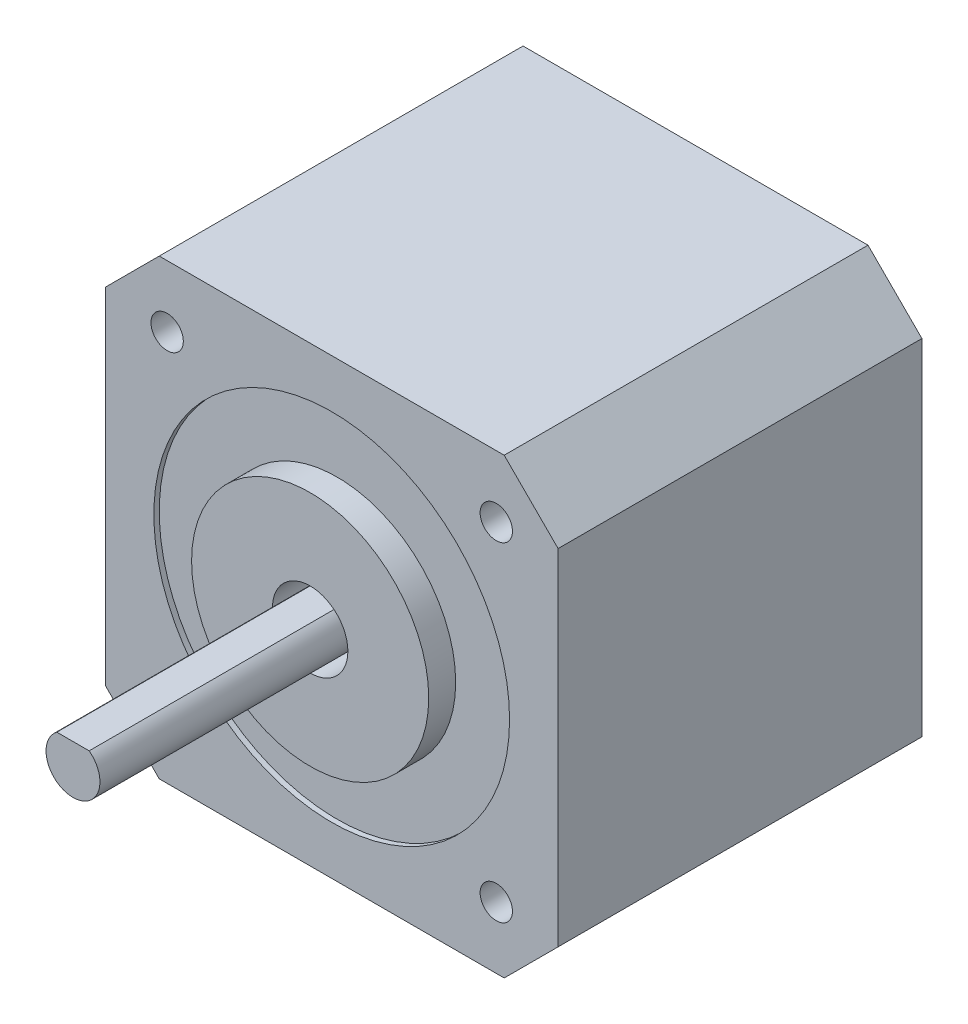
ISO-10303-21;
HEADER;
FILE_DESCRIPTION(('STEP AP214'),'2;1');
FILE_NAME('part.step','',(''),(''),'','','');
FILE_SCHEMA(('AUTOMOTIVE_DESIGN { 1 0 10303 214 1 1 1 1 }'));
ENDSEC;
DATA;
#1=APPLICATION_CONTEXT('core data for automotive mechanical design processes');
#2=APPLICATION_PROTOCOL_DEFINITION('international standard','automotive_design',2000,#1);
#3=PRODUCT_CONTEXT('',#1,'mechanical');
#4=PRODUCT('Part','Part','',(#3));
#5=PRODUCT_RELATED_PRODUCT_CATEGORY('part','',(#4));
#6=PRODUCT_DEFINITION_FORMATION('','',#4);
#7=PRODUCT_DEFINITION_CONTEXT('part definition',#1,'design');
#8=PRODUCT_DEFINITION('design','',#6,#7);
#9=PRODUCT_DEFINITION_SHAPE('','',#8);
#10=(LENGTH_UNIT() NAMED_UNIT(*) SI_UNIT(.MILLI.,.METRE.));
#11=(NAMED_UNIT(*) PLANE_ANGLE_UNIT() SI_UNIT($,.RADIAN.));
#12=(NAMED_UNIT(*) SI_UNIT($,.STERADIAN.) SOLID_ANGLE_UNIT());
#13=UNCERTAINTY_MEASURE_WITH_UNIT(LENGTH_MEASURE(1.E-05),#10,'distance_accuracy_value','');
#14=(GEOMETRIC_REPRESENTATION_CONTEXT(3) GLOBAL_UNCERTAINTY_ASSIGNED_CONTEXT((#13)) GLOBAL_UNIT_ASSIGNED_CONTEXT((#10,
#11,#12)) REPRESENTATION_CONTEXT('',''));
#15=CARTESIAN_POINT('',(0.,0.,0.));
#16=DIRECTION('',(0.,0.,1.));
#17=DIRECTION('',(1.,0.,0.));
#18=AXIS2_PLACEMENT_3D('',#15,#16,#17);
#19=CARTESIAN_POINT('',(0.,0.,0.));
#20=DIRECTION('',(0.,0.,1.));
#21=DIRECTION('',(1.,0.,0.));
#22=AXIS2_PLACEMENT_3D('',#19,#20,#21);
#23=PLANE('',#22);
#24=CARTESIAN_POINT('',(-34.2472819078425,39.9049488656762,0.));
#25=DIRECTION('',(0.,0.,1.));
#26=DIRECTION('',(1.,0.,0.));
#27=AXIS2_PLACEMENT_3D('',#24,#25,#26);
#28=CIRCLE('',#27,1.5);
#29=CARTESIAN_POINT('',(-32.7472819078425,39.9049488656762,0.));
#30=VERTEX_POINT('',#29);
#31=EDGE_CURVE('E260',#30,#30,#28,.T.);
#32=ORIENTED_EDGE('',*,*,#31,.T.);
#33=EDGE_LOOP('',(#32));
#34=FACE_BOUND('',#33,.T.);
#35=CARTESIAN_POINT('',(-34.2472819078425,9.3720780540411,0.));
#36=DIRECTION('',(0.,0.,1.));
#37=DIRECTION('',(1.,0.,0.));
#38=AXIS2_PLACEMENT_3D('',#35,#36,#37);
#39=CIRCLE('',#38,1.5);
#40=CARTESIAN_POINT('',(-32.7472819078425,9.3720780540411,0.));
#41=VERTEX_POINT('',#40);
#42=EDGE_CURVE('E248',#41,#41,#39,.T.);
#43=ORIENTED_EDGE('',*,*,#42,.T.);
#44=EDGE_LOOP('',(#43));
#45=FACE_BOUND('',#44,.T.);
#46=DIRECTION('',(0.,-1.,0.));
#47=VECTOR('',#46,1.);
#48=CARTESIAN_POINT('',(-39.9808465020249,40.6385134598587,0.));
#49=LINE('',#48,#47);
#50=CARTESIAN_POINT('',(-39.9808465020249,40.6385134598587,0.));
#51=VERTEX_POINT('',#50);
#52=CARTESIAN_POINT('',(-39.9808465020249,8.63851345985866,0.));
#53=VERTEX_POINT('',#52);
#54=EDGE_CURVE('E143',#51,#53,#49,.T.);
#55=ORIENTED_EDGE('',*,*,#54,.F.);
#56=DIRECTION('',(-0.707106781186547,-0.707106781186547,0.));
#57=VECTOR('',#56,1.);
#58=CARTESIAN_POINT('',(-34.9808465020249,45.6385134598587,0.));
#59=LINE('',#58,#57);
#60=CARTESIAN_POINT('',(-34.9808465020249,45.6385134598587,0.));
#61=VERTEX_POINT('',#60);
#62=EDGE_CURVE('E91',#61,#51,#59,.T.);
#63=ORIENTED_EDGE('',*,*,#62,.F.);
#64=DIRECTION('',(-1.,0.,0.));
#65=VECTOR('',#64,1.);
#66=CARTESIAN_POINT('',(-34.9808465020249,45.6385134598587,0.));
#67=LINE('',#66,#65);
#68=CARTESIAN_POINT('',(-2.98084650202495,45.6385134598587,0.));
#69=VERTEX_POINT('',#68);
#70=EDGE_CURVE('E156',#69,#61,#67,.T.);
#71=ORIENTED_EDGE('',*,*,#70,.F.);
#72=DIRECTION('',(-0.707106781186548,0.707106781186547,0.));
#73=VECTOR('',#72,1.);
#74=CARTESIAN_POINT('',(-2.98084650202495,45.6385134598587,0.));
#75=LINE('',#74,#73);
#76=CARTESIAN_POINT('',(2.01915349797506,40.6385134598587,0.));
#77=VERTEX_POINT('',#76);
#78=EDGE_CURVE('E131',#77,#69,#75,.T.);
#79=ORIENTED_EDGE('',*,*,#78,.F.);
#80=DIRECTION('',(0.,1.,0.));
#81=VECTOR('',#80,1.);
#82=CARTESIAN_POINT('',(2.01915349797506,40.6385134598587,0.));
#83=LINE('',#82,#81);
#84=CARTESIAN_POINT('',(2.01915349797507,8.63851345985866,0.));
#85=VERTEX_POINT('',#84);
#86=EDGE_CURVE('E153',#85,#77,#83,.T.);
#87=ORIENTED_EDGE('',*,*,#86,.F.);
#88=DIRECTION('',(0.707106781186547,0.707106781186548,0.));
#89=VECTOR('',#88,1.);
#90=CARTESIAN_POINT('',(2.01915349797507,8.63851345985866,0.));
#91=LINE('',#90,#89);
#92=CARTESIAN_POINT('',(-2.98084650202493,3.63851345985865,0.));
#93=VERTEX_POINT('',#92);
#94=EDGE_CURVE('E151',#93,#85,#91,.T.);
#95=ORIENTED_EDGE('',*,*,#94,.F.);
#96=DIRECTION('',(1.,0.,0.));
#97=VECTOR('',#96,1.);
#98=CARTESIAN_POINT('',(-34.9808465020249,3.63851345985865,0.));
#99=LINE('',#98,#97);
#100=CARTESIAN_POINT('',(-34.9808465020249,3.63851345985865,0.));
#101=VERTEX_POINT('',#100);
#102=EDGE_CURVE('E149',#101,#93,#99,.T.);
#103=ORIENTED_EDGE('',*,*,#102,.F.);
#104=DIRECTION('',(0.707106781186547,-0.707106781186548,0.));
#105=VECTOR('',#104,1.);
#106=CARTESIAN_POINT('',(-39.9808465020249,8.63851345985866,0.));
#107=LINE('',#106,#105);
#108=EDGE_CURVE('E146',#53,#101,#107,.T.);
#109=ORIENTED_EDGE('',*,*,#108,.F.);
#110=EDGE_LOOP('',(#55,#63,#71,#79,#87,#95,#103,#109));
#111=FACE_BOUND('',#110,.T.);
#112=CARTESIAN_POINT('',(-3.71441109620737,9.3720780540411,0.));
#113=DIRECTION('',(0.,0.,1.));
#114=DIRECTION('',(1.,0.,0.));
#115=AXIS2_PLACEMENT_3D('',#112,#113,#114);
#116=CIRCLE('',#115,1.5);
#117=CARTESIAN_POINT('',(-2.21441109620737,9.3720780540411,0.));
#118=VERTEX_POINT('',#117);
#119=EDGE_CURVE('E254',#118,#118,#116,.T.);
#120=ORIENTED_EDGE('',*,*,#119,.T.);
#121=EDGE_LOOP('',(#120));
#122=FACE_BOUND('',#121,.T.);
#123=CARTESIAN_POINT('',(-3.71441109620737,39.9049488656762,0.));
#124=DIRECTION('',(0.,0.,1.));
#125=DIRECTION('',(1.,0.,0.));
#126=AXIS2_PLACEMENT_3D('',#123,#124,#125);
#127=CIRCLE('',#126,1.5);
#128=CARTESIAN_POINT('',(-2.21441109620737,39.9049488656762,0.));
#129=VERTEX_POINT('',#128);
#130=EDGE_CURVE('E266',#129,#129,#127,.T.);
#131=ORIENTED_EDGE('',*,*,#130,.T.);
#132=EDGE_LOOP('',(#131));
#133=FACE_BOUND('',#132,.T.);
#134=ADVANCED_FACE('F34',(#34,#45,#111,#122,#133),#23,.F.);
#135=CARTESIAN_POINT('',(-18.9808465020249,24.6385134598587,30.75));
#136=DIRECTION('',(0.,0.,1.));
#137=DIRECTION('',(1.,0.,0.));
#138=AXIS2_PLACEMENT_3D('',#135,#136,#137);
#139=PLANE('',#138);
#140=CARTESIAN_POINT('',(-18.9808465020249,24.6385134598587,30.75));
#141=DIRECTION('',(0.,0.,1.));
#142=DIRECTION('',(1.,0.,0.));
#143=AXIS2_PLACEMENT_3D('',#140,#141,#142);
#144=CIRCLE('',#143,3.5);
#145=CARTESIAN_POINT('',(-15.4808465020249,24.6385134598587,30.75));
#146=VERTEX_POINT('',#145);
#147=EDGE_CURVE('E201',#146,#146,#144,.T.);
#148=ORIENTED_EDGE('',*,*,#147,.T.);
#149=EDGE_LOOP('',(#148));
#150=FACE_BOUND('',#149,.T.);
#151=DIRECTION('',(-1.,0.,0.));
#152=VECTOR('',#151,1.);
#153=CARTESIAN_POINT('',(-20.4808465020249,26.6385134598587,30.75));
#154=LINE('',#153,#152);
#155=CARTESIAN_POINT('',(-17.4808465020249,26.6385134598587,30.75));
#156=VERTEX_POINT('',#155);
#157=CARTESIAN_POINT('',(-20.4808465020249,26.6385134598587,30.75));
#158=VERTEX_POINT('',#157);
#159=EDGE_CURVE('E214',#156,#158,#154,.T.);
#160=ORIENTED_EDGE('',*,*,#159,.F.);
#161=CARTESIAN_POINT('',(-18.9808465020249,24.6385134598587,30.75));
#162=DIRECTION('',(0.,0.,1.));
#163=DIRECTION('',(1.,0.,0.));
#164=AXIS2_PLACEMENT_3D('',#161,#162,#163);
#165=CIRCLE('',#164,2.5);
#166=EDGE_CURVE('E49',#158,#156,#165,.T.);
#167=ORIENTED_EDGE('',*,*,#166,.F.);
#168=EDGE_LOOP('',(#160,#167));
#169=FACE_BOUND('',#168,.T.);
#170=ADVANCED_FACE('F284',(#150,#169),#139,.T.);
#171=CARTESIAN_POINT('',(-18.9808465020249,24.6385134598587,33.25));
#172=DIRECTION('',(0.,0.,1.));
#173=DIRECTION('',(1.,0.,0.));
#174=AXIS2_PLACEMENT_3D('',#171,#172,#173);
#175=PLANE('',#174);
#176=CARTESIAN_POINT('',(-18.9808465020249,24.6385134598587,33.25));
#177=DIRECTION('',(0.,0.,1.));
#178=DIRECTION('',(1.,0.,0.));
#179=AXIS2_PLACEMENT_3D('',#176,#177,#178);
#180=CIRCLE('',#179,16.5);
#181=CARTESIAN_POINT('',(-2.48084650202493,24.6385134598587,33.25));
#182=VERTEX_POINT('',#181);
#183=EDGE_CURVE('E147',#182,#182,#180,.T.);
#184=ORIENTED_EDGE('',*,*,#183,.T.);
#185=EDGE_LOOP('',(#184));
#186=FACE_BOUND('',#185,.T.);
#187=CARTESIAN_POINT('',(-18.9808465020249,24.6385134598587,33.25));
#188=DIRECTION('',(0.,0.,1.));
#189=DIRECTION('',(1.,0.,0.));
#190=AXIS2_PLACEMENT_3D('',#187,#188,#189);
#191=CIRCLE('',#190,11.);
#192=CARTESIAN_POINT('',(-7.98084650202494,24.6385134598587,33.25));
#193=VERTEX_POINT('',#192);
#194=EDGE_CURVE('E198',#193,#193,#191,.T.);
#195=ORIENTED_EDGE('',*,*,#194,.F.);
#196=EDGE_LOOP('',(#195));
#197=FACE_BOUND('',#196,.T.);
#198=ADVANCED_FACE('F290',(#186,#197),#175,.T.);
#199=CARTESIAN_POINT('',(-39.9808465020249,40.6385134598587,33.75));
#200=DIRECTION('',(1.,0.,0.));
#201=DIRECTION('',(0.,1.,0.));
#202=AXIS2_PLACEMENT_3D('',#199,#200,#201);
#203=PLANE('',#202);
#204=ORIENTED_EDGE('',*,*,#54,.T.);
#205=DIRECTION('',(0.,0.,-1.));
#206=VECTOR('',#205,1.);
#207=CARTESIAN_POINT('',(-39.9808465020249,8.63851345985866,33.75));
#208=LINE('',#207,#206);
#209=CARTESIAN_POINT('',(-39.9808465020249,8.63851345985866,33.75));
#210=VERTEX_POINT('',#209);
#211=EDGE_CURVE('E11',#210,#53,#208,.T.);
#212=ORIENTED_EDGE('',*,*,#211,.F.);
#213=DIRECTION('',(0.,-1.,0.));
#214=VECTOR('',#213,1.);
#215=CARTESIAN_POINT('',(-39.9808465020249,40.6385134598587,33.75));
#216=LINE('',#215,#214);
#217=CARTESIAN_POINT('',(-39.9808465020249,40.6385134598587,33.75));
#218=VERTEX_POINT('',#217);
#219=EDGE_CURVE('E159',#218,#210,#216,.T.);
#220=ORIENTED_EDGE('',*,*,#219,.F.);
#221=DIRECTION('',(0.,0.,-1.));
#222=VECTOR('',#221,1.);
#223=CARTESIAN_POINT('',(-39.9808465020249,40.6385134598587,33.75));
#224=LINE('',#223,#222);
#225=EDGE_CURVE('E139',#218,#51,#224,.T.);
#226=ORIENTED_EDGE('',*,*,#225,.T.);
#227=EDGE_LOOP('',(#204,#212,#220,#226));
#228=FACE_BOUND('',#227,.T.);
#229=ADVANCED_FACE('F36',(#228),#203,.F.);
#230=CARTESIAN_POINT('',(-39.9808465020249,8.63851345985866,33.75));
#231=DIRECTION('',(0.707106781186548,0.707106781186547,0.));
#232=DIRECTION('',(-0.707106781186547,0.707106781186548,0.));
#233=AXIS2_PLACEMENT_3D('',#230,#231,#232);
#234=PLANE('',#233);
#235=ORIENTED_EDGE('',*,*,#108,.T.);
#236=DIRECTION('',(0.,0.,-1.));
#237=VECTOR('',#236,1.);
#238=CARTESIAN_POINT('',(-34.9808465020249,3.63851345985865,33.75));
#239=LINE('',#238,#237);
#240=CARTESIAN_POINT('',(-34.9808465020249,3.63851345985865,33.75));
#241=VERTEX_POINT('',#240);
#242=EDGE_CURVE('E42',#241,#101,#239,.T.);
#243=ORIENTED_EDGE('',*,*,#242,.F.);
#244=DIRECTION('',(0.707106781186547,-0.707106781186548,0.));
#245=VECTOR('',#244,1.);
#246=CARTESIAN_POINT('',(-39.9808465020249,8.63851345985866,33.75));
#247=LINE('',#246,#245);
#248=EDGE_CURVE('E99',#210,#241,#247,.T.);
#249=ORIENTED_EDGE('',*,*,#248,.F.);
#250=ORIENTED_EDGE('',*,*,#211,.T.);
#251=EDGE_LOOP('',(#235,#243,#249,#250));
#252=FACE_BOUND('',#251,.T.);
#253=ADVANCED_FACE('F309',(#252),#234,.F.);
#254=CARTESIAN_POINT('',(-34.9808465020249,3.63851345985865,33.75));
#255=DIRECTION('',(0.,1.,0.));
#256=DIRECTION('',(0.,0.,1.));
#257=AXIS2_PLACEMENT_3D('',#254,#255,#256);
#258=PLANE('',#257);
#259=ORIENTED_EDGE('',*,*,#102,.T.);
#260=DIRECTION('',(0.,0.,-1.));
#261=VECTOR('',#260,1.);
#262=CARTESIAN_POINT('',(-2.98084650202493,3.63851345985865,33.75));
#263=LINE('',#262,#261);
#264=CARTESIAN_POINT('',(-2.98084650202493,3.63851345985865,33.75));
#265=VERTEX_POINT('',#264);
#266=EDGE_CURVE('E166',#265,#93,#263,.T.);
#267=ORIENTED_EDGE('',*,*,#266,.F.);
#268=DIRECTION('',(1.,0.,0.));
#269=VECTOR('',#268,1.);
#270=CARTESIAN_POINT('',(-34.9808465020249,3.63851345985865,33.75));
#271=LINE('',#270,#269);
#272=EDGE_CURVE('E174',#241,#265,#271,.T.);
#273=ORIENTED_EDGE('',*,*,#272,.F.);
#274=ORIENTED_EDGE('',*,*,#242,.T.);
#275=EDGE_LOOP('',(#259,#267,#273,#274));
#276=FACE_BOUND('',#275,.T.);
#277=ADVANCED_FACE('F172',(#276),#258,.F.);
#278=CARTESIAN_POINT('',(2.01915349797507,8.63851345985866,33.75));
#279=DIRECTION('',(-0.707106781186548,0.707106781186547,0.));
#280=DIRECTION('',(-0.707106781186547,-0.707106781186548,0.));
#281=AXIS2_PLACEMENT_3D('',#278,#279,#280);
#282=PLANE('',#281);
#283=ORIENTED_EDGE('',*,*,#94,.T.);
#284=DIRECTION('',(0.,0.,-1.));
#285=VECTOR('',#284,1.);
#286=CARTESIAN_POINT('',(2.01915349797507,8.63851345985866,33.75));
#287=LINE('',#286,#285);
#288=CARTESIAN_POINT('',(2.01915349797507,8.63851345985866,33.75));
#289=VERTEX_POINT('',#288);
#290=EDGE_CURVE('E163',#289,#85,#287,.T.);
#291=ORIENTED_EDGE('',*,*,#290,.F.);
#292=DIRECTION('',(0.707106781186547,0.707106781186548,0.));
#293=VECTOR('',#292,1.);
#294=CARTESIAN_POINT('',(2.01915349797507,8.63851345985866,33.75));
#295=LINE('',#294,#293);
#296=EDGE_CURVE('E186',#265,#289,#295,.T.);
#297=ORIENTED_EDGE('',*,*,#296,.F.);
#298=ORIENTED_EDGE('',*,*,#266,.T.);
#299=EDGE_LOOP('',(#283,#291,#297,#298));
#300=FACE_BOUND('',#299,.T.);
#301=ADVANCED_FACE('F182',(#300),#282,.F.);
#302=CARTESIAN_POINT('',(2.01915349797506,40.6385134598587,33.75));
#303=DIRECTION('',(-1.,0.,0.));
#304=DIRECTION('',(0.,-1.,0.));
#305=AXIS2_PLACEMENT_3D('',#302,#303,#304);
#306=PLANE('',#305);
#307=ORIENTED_EDGE('',*,*,#86,.T.);
#308=DIRECTION('',(0.,0.,-1.));
#309=VECTOR('',#308,1.);
#310=CARTESIAN_POINT('',(2.01915349797506,40.6385134598587,33.75));
#311=LINE('',#310,#309);
#312=CARTESIAN_POINT('',(2.01915349797506,40.6385134598587,33.75));
#313=VERTEX_POINT('',#312);
#314=EDGE_CURVE('E134',#313,#77,#311,.T.);
#315=ORIENTED_EDGE('',*,*,#314,.F.);
#316=DIRECTION('',(0.,1.,0.));
#317=VECTOR('',#316,1.);
#318=CARTESIAN_POINT('',(2.01915349797506,40.6385134598587,33.75));
#319=LINE('',#318,#317);
#320=EDGE_CURVE('E122',#289,#313,#319,.T.);
#321=ORIENTED_EDGE('',*,*,#320,.F.);
#322=ORIENTED_EDGE('',*,*,#290,.T.);
#323=EDGE_LOOP('',(#307,#315,#321,#322));
#324=FACE_BOUND('',#323,.T.);
#325=ADVANCED_FACE('F185',(#324),#306,.F.);
#326=CARTESIAN_POINT('',(-2.98084650202495,45.6385134598587,33.75));
#327=DIRECTION('',(-0.707106781186547,-0.707106781186548,0.));
#328=DIRECTION('',(0.707106781186548,-0.707106781186547,0.));
#329=AXIS2_PLACEMENT_3D('',#326,#327,#328);
#330=PLANE('',#329);
#331=ORIENTED_EDGE('',*,*,#78,.T.);
#332=DIRECTION('',(0.,0.,-1.));
#333=VECTOR('',#332,1.);
#334=CARTESIAN_POINT('',(-2.98084650202495,45.6385134598587,33.75));
#335=LINE('',#334,#333);
#336=CARTESIAN_POINT('',(-2.98084650202495,45.6385134598587,33.75));
#337=VERTEX_POINT('',#336);
#338=EDGE_CURVE('E128',#337,#69,#335,.T.);
#339=ORIENTED_EDGE('',*,*,#338,.F.);
#340=DIRECTION('',(-0.707106781186548,0.707106781186547,0.));
#341=VECTOR('',#340,1.);
#342=CARTESIAN_POINT('',(-2.98084650202495,45.6385134598587,33.75));
#343=LINE('',#342,#341);
#344=EDGE_CURVE('E115',#313,#337,#343,.T.);
#345=ORIENTED_EDGE('',*,*,#344,.F.);
#346=ORIENTED_EDGE('',*,*,#314,.T.);
#347=EDGE_LOOP('',(#331,#339,#345,#346));
#348=FACE_BOUND('',#347,.T.);
#349=ADVANCED_FACE('F129',(#348),#330,.F.);
#350=CARTESIAN_POINT('',(-34.9808465020249,45.6385134598587,33.75));
#351=DIRECTION('',(0.,-1.,0.));
#352=DIRECTION('',(0.,0.,-1.));
#353=AXIS2_PLACEMENT_3D('',#350,#351,#352);
#354=PLANE('',#353);
#355=ORIENTED_EDGE('',*,*,#70,.T.);
#356=DIRECTION('',(0.,0.,-1.));
#357=VECTOR('',#356,1.);
#358=CARTESIAN_POINT('',(-34.9808465020249,45.6385134598587,33.75));
#359=LINE('',#358,#357);
#360=CARTESIAN_POINT('',(-34.9808465020249,45.6385134598587,33.75));
#361=VERTEX_POINT('',#360);
#362=EDGE_CURVE('E135',#361,#61,#359,.T.);
#363=ORIENTED_EDGE('',*,*,#362,.F.);
#364=DIRECTION('',(-1.,0.,0.));
#365=VECTOR('',#364,1.);
#366=CARTESIAN_POINT('',(-34.9808465020249,45.6385134598587,33.75));
#367=LINE('',#366,#365);
#368=EDGE_CURVE('E119',#337,#361,#367,.T.);
#369=ORIENTED_EDGE('',*,*,#368,.F.);
#370=ORIENTED_EDGE('',*,*,#338,.T.);
#371=EDGE_LOOP('',(#355,#363,#369,#370));
#372=FACE_BOUND('',#371,.T.);
#373=ADVANCED_FACE('F137',(#372),#354,.F.);
#374=CARTESIAN_POINT('',(-34.9808465020249,45.6385134598587,33.75));
#375=DIRECTION('',(0.707106781186548,-0.707106781186548,0.));
#376=DIRECTION('',(0.707106781186548,0.707106781186548,0.));
#377=AXIS2_PLACEMENT_3D('',#374,#375,#376);
#378=PLANE('',#377);
#379=ORIENTED_EDGE('',*,*,#62,.T.);
#380=ORIENTED_EDGE('',*,*,#225,.F.);
#381=DIRECTION('',(-0.707106781186547,-0.707106781186547,0.));
#382=VECTOR('',#381,1.);
#383=CARTESIAN_POINT('',(-34.9808465020249,45.6385134598587,33.75));
#384=LINE('',#383,#382);
#385=EDGE_CURVE('E58',#361,#218,#384,.T.);
#386=ORIENTED_EDGE('',*,*,#385,.F.);
#387=ORIENTED_EDGE('',*,*,#362,.T.);
#388=EDGE_LOOP('',(#379,#380,#386,#387));
#389=FACE_BOUND('',#388,.T.);
#390=ADVANCED_FACE('F297',(#389),#378,.F.);
#391=CARTESIAN_POINT('',(0.,0.,33.75));
#392=DIRECTION('',(0.,0.,1.));
#393=DIRECTION('',(1.,0.,0.));
#394=AXIS2_PLACEMENT_3D('',#391,#392,#393);
#395=PLANE('',#394);
#396=CARTESIAN_POINT('',(-3.71441109620737,39.9049488656762,33.75));
#397=DIRECTION('',(0.,0.,1.));
#398=DIRECTION('',(1.,0.,0.));
#399=AXIS2_PLACEMENT_3D('',#396,#397,#398);
#400=CIRCLE('',#399,1.5);
#401=CARTESIAN_POINT('',(-2.21441109620737,39.9049488656762,33.75));
#402=VERTEX_POINT('',#401);
#403=EDGE_CURVE('E239',#402,#402,#400,.T.);
#404=ORIENTED_EDGE('',*,*,#403,.F.);
#405=EDGE_LOOP('',(#404));
#406=FACE_BOUND('',#405,.T.);
#407=CARTESIAN_POINT('',(-34.2472819078425,39.9049488656762,33.75));
#408=DIRECTION('',(0.,0.,1.));
#409=DIRECTION('',(1.,0.,0.));
#410=AXIS2_PLACEMENT_3D('',#407,#408,#409);
#411=CIRCLE('',#410,1.5);
#412=CARTESIAN_POINT('',(-32.7472819078425,39.9049488656762,33.75));
#413=VERTEX_POINT('',#412);
#414=EDGE_CURVE('E233',#413,#413,#411,.T.);
#415=ORIENTED_EDGE('',*,*,#414,.F.);
#416=EDGE_LOOP('',(#415));
#417=FACE_BOUND('',#416,.T.);
#418=CARTESIAN_POINT('',(-3.71441109620737,9.3720780540411,33.75));
#419=DIRECTION('',(0.,0.,1.));
#420=DIRECTION('',(1.,0.,0.));
#421=AXIS2_PLACEMENT_3D('',#418,#419,#420);
#422=CIRCLE('',#421,1.5);
#423=CARTESIAN_POINT('',(-2.21441109620737,9.3720780540411,33.75));
#424=VERTEX_POINT('',#423);
#425=EDGE_CURVE('E227',#424,#424,#422,.T.);
#426=ORIENTED_EDGE('',*,*,#425,.F.);
#427=EDGE_LOOP('',(#426));
#428=FACE_BOUND('',#427,.T.);
#429=CARTESIAN_POINT('',(-34.2472819078425,9.3720780540411,33.75));
#430=DIRECTION('',(0.,0.,1.));
#431=DIRECTION('',(1.,0.,0.));
#432=AXIS2_PLACEMENT_3D('',#429,#430,#431);
#433=CIRCLE('',#432,1.5);
#434=CARTESIAN_POINT('',(-32.7472819078425,9.3720780540411,33.75));
#435=VERTEX_POINT('',#434);
#436=EDGE_CURVE('E224',#435,#435,#433,.T.);
#437=ORIENTED_EDGE('',*,*,#436,.F.);
#438=EDGE_LOOP('',(#437));
#439=FACE_BOUND('',#438,.T.);
#440=CARTESIAN_POINT('',(-18.9808465020249,24.6385134598587,33.75));
#441=DIRECTION('',(0.,0.,1.));
#442=DIRECTION('',(1.,0.,0.));
#443=AXIS2_PLACEMENT_3D('',#440,#441,#442);
#444=CIRCLE('',#443,16.5);
#445=CARTESIAN_POINT('',(-2.48084650202493,24.6385134598587,33.75));
#446=VERTEX_POINT('',#445);
#447=EDGE_CURVE('E192',#446,#446,#444,.T.);
#448=ORIENTED_EDGE('',*,*,#447,.F.);
#449=EDGE_LOOP('',(#448));
#450=FACE_BOUND('',#449,.T.);
#451=ORIENTED_EDGE('',*,*,#219,.T.);
#452=ORIENTED_EDGE('',*,*,#248,.T.);
#453=ORIENTED_EDGE('',*,*,#272,.T.);
#454=ORIENTED_EDGE('',*,*,#296,.T.);
#455=ORIENTED_EDGE('',*,*,#320,.T.);
#456=ORIENTED_EDGE('',*,*,#344,.T.);
#457=ORIENTED_EDGE('',*,*,#368,.T.);
#458=ORIENTED_EDGE('',*,*,#385,.T.);
#459=EDGE_LOOP('',(#451,#452,#453,#454,#455,#456,#457,#458));
#460=FACE_BOUND('',#459,.T.);
#461=ADVANCED_FACE('F117',(#406,#417,#428,#439,#450,#460),#395,.T.);
#462=CARTESIAN_POINT('',(-18.9808465020249,24.6385134598587,33.25));
#463=DIRECTION('',(0.,0.,1.));
#464=DIRECTION('',(1.,0.,0.));
#465=AXIS2_PLACEMENT_3D('',#462,#463,#464);
#466=CYLINDRICAL_SURFACE('',#465,16.5);
#467=ORIENTED_EDGE('',*,*,#183,.F.);
#468=EDGE_LOOP('',(#467));
#469=FACE_BOUND('',#468,.T.);
#470=ORIENTED_EDGE('',*,*,#447,.T.);
#471=EDGE_LOOP('',(#470));
#472=FACE_BOUND('',#471,.T.);
#473=ADVANCED_FACE('F328',(#469,#472),#466,.F.);
#474=CARTESIAN_POINT('',(-18.9808465020249,24.6385134598587,35.75));
#475=DIRECTION('',(0.,0.,-1.));
#476=DIRECTION('',(-1.,0.,0.));
#477=AXIS2_PLACEMENT_3D('',#474,#475,#476);
#478=CYLINDRICAL_SURFACE('',#477,11.);
#479=CARTESIAN_POINT('',(-18.9808465020249,24.6385134598587,35.75));
#480=DIRECTION('',(0.,0.,1.));
#481=DIRECTION('',(1.,0.,0.));
#482=AXIS2_PLACEMENT_3D('',#479,#480,#481);
#483=CIRCLE('',#482,11.);
#484=CARTESIAN_POINT('',(-7.98084650202494,24.6385134598587,35.75));
#485=VERTEX_POINT('',#484);
#486=EDGE_CURVE('E195',#485,#485,#483,.T.);
#487=ORIENTED_EDGE('',*,*,#486,.F.);
#488=EDGE_LOOP('',(#487));
#489=FACE_BOUND('',#488,.T.);
#490=ORIENTED_EDGE('',*,*,#194,.T.);
#491=EDGE_LOOP('',(#490));
#492=FACE_BOUND('',#491,.T.);
#493=ADVANCED_FACE('F326',(#489,#492),#478,.T.);
#494=CARTESIAN_POINT('',(-18.9808465020249,24.6385134598587,35.75));
#495=DIRECTION('',(0.,0.,1.));
#496=DIRECTION('',(1.,0.,0.));
#497=AXIS2_PLACEMENT_3D('',#494,#495,#496);
#498=PLANE('',#497);
#499=CARTESIAN_POINT('',(-18.9808465020249,24.6385134598587,35.75));
#500=DIRECTION('',(0.,0.,1.));
#501=DIRECTION('',(1.,0.,0.));
#502=AXIS2_PLACEMENT_3D('',#499,#500,#501);
#503=CIRCLE('',#502,3.5);
#504=CARTESIAN_POINT('',(-15.4808465020249,24.6385134598587,35.75));
#505=VERTEX_POINT('',#504);
#506=EDGE_CURVE('E204',#505,#505,#503,.T.);
#507=ORIENTED_EDGE('',*,*,#506,.F.);
#508=EDGE_LOOP('',(#507));
#509=FACE_BOUND('',#508,.T.);
#510=ORIENTED_EDGE('',*,*,#486,.T.);
#511=EDGE_LOOP('',(#510));
#512=FACE_BOUND('',#511,.T.);
#513=ADVANCED_FACE('F335',(#509,#512),#498,.T.);
#514=CARTESIAN_POINT('',(-18.9808465020249,24.6385134598587,30.75));
#515=DIRECTION('',(0.,0.,1.));
#516=DIRECTION('',(1.,0.,0.));
#517=AXIS2_PLACEMENT_3D('',#514,#515,#516);
#518=CYLINDRICAL_SURFACE('',#517,3.5);
#519=ORIENTED_EDGE('',*,*,#147,.F.);
#520=EDGE_LOOP('',(#519));
#521=FACE_BOUND('',#520,.T.);
#522=ORIENTED_EDGE('',*,*,#506,.T.);
#523=EDGE_LOOP('',(#522));
#524=FACE_BOUND('',#523,.T.);
#525=ADVANCED_FACE('F376',(#521,#524),#518,.F.);
#526=CARTESIAN_POINT('',(-18.9808465020249,24.6385134598587,57.75));
#527=DIRECTION('',(0.,0.,-1.));
#528=DIRECTION('',(-1.,0.,0.));
#529=AXIS2_PLACEMENT_3D('',#526,#527,#528);
#530=CYLINDRICAL_SURFACE('',#529,2.5);
#531=ORIENTED_EDGE('',*,*,#166,.T.);
#532=DIRECTION('',(0.,0.,-1.));
#533=VECTOR('',#532,1.);
#534=CARTESIAN_POINT('',(-17.4808465020249,26.6385134598587,57.75));
#535=LINE('',#534,#533);
#536=CARTESIAN_POINT('',(-17.4808465020249,26.6385134598587,57.75));
#537=VERTEX_POINT('',#536);
#538=EDGE_CURVE('E207',#537,#156,#535,.T.);
#539=ORIENTED_EDGE('',*,*,#538,.F.);
#540=CARTESIAN_POINT('',(-18.9808465020249,24.6385134598587,57.75));
#541=DIRECTION('',(0.,0.,1.));
#542=DIRECTION('',(1.,0.,0.));
#543=AXIS2_PLACEMENT_3D('',#540,#541,#542);
#544=CIRCLE('',#543,2.5);
#545=CARTESIAN_POINT('',(-20.4808465020249,26.6385134598587,57.75));
#546=VERTEX_POINT('',#545);
#547=EDGE_CURVE('E217',#546,#537,#544,.T.);
#548=ORIENTED_EDGE('',*,*,#547,.F.);
#549=DIRECTION('',(0.,0.,-1.));
#550=VECTOR('',#549,1.);
#551=CARTESIAN_POINT('',(-20.4808465020249,26.6385134598587,57.75));
#552=LINE('',#551,#550);
#553=EDGE_CURVE('E211',#546,#158,#552,.T.);
#554=ORIENTED_EDGE('',*,*,#553,.T.);
#555=EDGE_LOOP('',(#531,#539,#548,#554));
#556=FACE_BOUND('',#555,.T.);
#557=ADVANCED_FACE('F373',(#556),#530,.T.);
#558=CARTESIAN_POINT('',(-20.4808465020249,26.6385134598587,57.75));
#559=DIRECTION('',(0.,-1.,0.));
#560=DIRECTION('',(0.,0.,-1.));
#561=AXIS2_PLACEMENT_3D('',#558,#559,#560);
#562=PLANE('',#561);
#563=ORIENTED_EDGE('',*,*,#159,.T.);
#564=ORIENTED_EDGE('',*,*,#553,.F.);
#565=DIRECTION('',(-1.,0.,0.));
#566=VECTOR('',#565,1.);
#567=CARTESIAN_POINT('',(-20.4808465020249,26.6385134598587,57.75));
#568=LINE('',#567,#566);
#569=EDGE_CURVE('E213',#537,#546,#568,.T.);
#570=ORIENTED_EDGE('',*,*,#569,.F.);
#571=ORIENTED_EDGE('',*,*,#538,.T.);
#572=EDGE_LOOP('',(#563,#564,#570,#571));
#573=FACE_BOUND('',#572,.T.);
#574=ADVANCED_FACE('F365',(#573),#562,.F.);
#575=CARTESIAN_POINT('',(-18.9808465020249,24.6385134598587,57.75));
#576=DIRECTION('',(0.,0.,1.));
#577=DIRECTION('',(1.,0.,0.));
#578=AXIS2_PLACEMENT_3D('',#575,#576,#577);
#579=PLANE('',#578);
#580=ORIENTED_EDGE('',*,*,#547,.T.);
#581=ORIENTED_EDGE('',*,*,#569,.T.);
#582=EDGE_LOOP('',(#580,#581));
#583=FACE_BOUND('',#582,.T.);
#584=ADVANCED_FACE('F355',(#583),#579,.T.);
#585=CARTESIAN_POINT('',(-34.2472819078425,9.3720780540411,28.75));
#586=DIRECTION('',(0.,0.,1.));
#587=DIRECTION('',(1.,0.,0.));
#588=AXIS2_PLACEMENT_3D('',#585,#586,#587);
#589=CYLINDRICAL_SURFACE('',#588,1.5);
#590=CARTESIAN_POINT('',(-34.2472819078425,9.3720780540411,28.75));
#591=DIRECTION('',(0.,0.,1.));
#592=DIRECTION('',(1.,0.,0.));
#593=AXIS2_PLACEMENT_3D('',#590,#591,#592);
#594=CIRCLE('',#593,1.5);
#595=CARTESIAN_POINT('',(-32.7472819078425,9.3720780540411,28.75));
#596=VERTEX_POINT('',#595);
#597=EDGE_CURVE('E219',#596,#596,#594,.T.);
#598=ORIENTED_EDGE('',*,*,#597,.F.);
#599=EDGE_LOOP('',(#598));
#600=FACE_BOUND('',#599,.T.);
#601=ORIENTED_EDGE('',*,*,#436,.T.);
#602=EDGE_LOOP('',(#601));
#603=FACE_BOUND('',#602,.T.);
#604=ADVANCED_FACE('F352',(#600,#603),#589,.F.);
#605=CARTESIAN_POINT('',(-34.2472819078425,9.3720780540411,28.75));
#606=DIRECTION('',(0.,0.,1.));
#607=DIRECTION('',(1.,0.,0.));
#608=AXIS2_PLACEMENT_3D('',#605,#606,#607);
#609=PLANE('',#608);
#610=ORIENTED_EDGE('',*,*,#597,.T.);
#611=EDGE_LOOP('',(#610));
#612=FACE_BOUND('',#611,.T.);
#613=ADVANCED_FACE('F354',(#612),#609,.T.);
#614=CARTESIAN_POINT('',(-3.71441109620737,9.3720780540411,28.75));
#615=DIRECTION('',(0.,0.,1.));
#616=DIRECTION('',(1.,0.,0.));
#617=AXIS2_PLACEMENT_3D('',#614,#615,#616);
#618=CYLINDRICAL_SURFACE('',#617,1.5);
#619=CARTESIAN_POINT('',(-3.71441109620737,9.3720780540411,28.75));
#620=DIRECTION('',(0.,0.,1.));
#621=DIRECTION('',(1.,0.,0.));
#622=AXIS2_PLACEMENT_3D('',#619,#620,#621);
#623=CIRCLE('',#622,1.5);
#624=CARTESIAN_POINT('',(-2.21441109620737,9.3720780540411,28.75));
#625=VERTEX_POINT('',#624);
#626=EDGE_CURVE('E230',#625,#625,#623,.T.);
#627=ORIENTED_EDGE('',*,*,#626,.F.);
#628=EDGE_LOOP('',(#627));
#629=FACE_BOUND('',#628,.T.);
#630=ORIENTED_EDGE('',*,*,#425,.T.);
#631=EDGE_LOOP('',(#630));
#632=FACE_BOUND('',#631,.T.);
#633=ADVANCED_FACE('F362',(#629,#632),#618,.F.);
#634=CARTESIAN_POINT('',(-3.71441109620737,9.3720780540411,28.75));
#635=DIRECTION('',(0.,0.,1.));
#636=DIRECTION('',(1.,0.,0.));
#637=AXIS2_PLACEMENT_3D('',#634,#635,#636);
#638=PLANE('',#637);
#639=ORIENTED_EDGE('',*,*,#626,.T.);
#640=EDGE_LOOP('',(#639));
#641=FACE_BOUND('',#640,.T.);
#642=ADVANCED_FACE('F434',(#641),#638,.T.);
#643=CARTESIAN_POINT('',(-34.2472819078425,39.9049488656762,28.75));
#644=DIRECTION('',(0.,0.,1.));
#645=DIRECTION('',(1.,0.,0.));
#646=AXIS2_PLACEMENT_3D('',#643,#644,#645);
#647=CYLINDRICAL_SURFACE('',#646,1.5);
#648=CARTESIAN_POINT('',(-34.2472819078425,39.9049488656762,28.75));
#649=DIRECTION('',(0.,0.,1.));
#650=DIRECTION('',(1.,0.,0.));
#651=AXIS2_PLACEMENT_3D('',#648,#649,#650);
#652=CIRCLE('',#651,1.5);
#653=CARTESIAN_POINT('',(-32.7472819078425,39.9049488656762,28.75));
#654=VERTEX_POINT('',#653);
#655=EDGE_CURVE('E236',#654,#654,#652,.T.);
#656=ORIENTED_EDGE('',*,*,#655,.F.);
#657=EDGE_LOOP('',(#656));
#658=FACE_BOUND('',#657,.T.);
#659=ORIENTED_EDGE('',*,*,#414,.T.);
#660=EDGE_LOOP('',(#659));
#661=FACE_BOUND('',#660,.T.);
#662=ADVANCED_FACE('F444',(#658,#661),#647,.F.);
#663=CARTESIAN_POINT('',(-34.2472819078425,39.9049488656762,28.75));
#664=DIRECTION('',(0.,0.,1.));
#665=DIRECTION('',(1.,0.,0.));
#666=AXIS2_PLACEMENT_3D('',#663,#664,#665);
#667=PLANE('',#666);
#668=ORIENTED_EDGE('',*,*,#655,.T.);
#669=EDGE_LOOP('',(#668));
#670=FACE_BOUND('',#669,.T.);
#671=ADVANCED_FACE('F453',(#670),#667,.T.);
#672=CARTESIAN_POINT('',(-3.71441109620737,39.9049488656762,28.75));
#673=DIRECTION('',(0.,0.,1.));
#674=DIRECTION('',(1.,0.,0.));
#675=AXIS2_PLACEMENT_3D('',#672,#673,#674);
#676=CYLINDRICAL_SURFACE('',#675,1.5);
#677=CARTESIAN_POINT('',(-3.71441109620737,39.9049488656762,28.75));
#678=DIRECTION('',(0.,0.,1.));
#679=DIRECTION('',(1.,0.,0.));
#680=AXIS2_PLACEMENT_3D('',#677,#678,#679);
#681=CIRCLE('',#680,1.5);
#682=CARTESIAN_POINT('',(-2.21441109620737,39.9049488656762,28.75));
#683=VERTEX_POINT('',#682);
#684=EDGE_CURVE('E242',#683,#683,#681,.T.);
#685=ORIENTED_EDGE('',*,*,#684,.F.);
#686=EDGE_LOOP('',(#685));
#687=FACE_BOUND('',#686,.T.);
#688=ORIENTED_EDGE('',*,*,#403,.T.);
#689=EDGE_LOOP('',(#688));
#690=FACE_BOUND('',#689,.T.);
#691=ADVANCED_FACE('F463',(#687,#690),#676,.F.);
#692=CARTESIAN_POINT('',(-3.71441109620737,39.9049488656762,28.75));
#693=DIRECTION('',(0.,0.,1.));
#694=DIRECTION('',(1.,0.,0.));
#695=AXIS2_PLACEMENT_3D('',#692,#693,#694);
#696=PLANE('',#695);
#697=ORIENTED_EDGE('',*,*,#684,.T.);
#698=EDGE_LOOP('',(#697));
#699=FACE_BOUND('',#698,.T.);
#700=ADVANCED_FACE('F473',(#699),#696,.T.);
#701=CARTESIAN_POINT('',(-34.2472819078425,9.3720780540411,5.));
#702=DIRECTION('',(0.,0.,-1.));
#703=DIRECTION('',(-1.,0.,0.));
#704=AXIS2_PLACEMENT_3D('',#701,#702,#703);
#705=CYLINDRICAL_SURFACE('',#704,1.5);
#706=CARTESIAN_POINT('',(-34.2472819078425,9.3720780540411,5.));
#707=DIRECTION('',(0.,0.,1.));
#708=DIRECTION('',(1.,0.,0.));
#709=AXIS2_PLACEMENT_3D('',#706,#707,#708);
#710=CIRCLE('',#709,1.5);
#711=CARTESIAN_POINT('',(-32.7472819078425,9.3720780540411,5.));
#712=VERTEX_POINT('',#711);
#713=EDGE_CURVE('E245',#712,#712,#710,.T.);
#714=ORIENTED_EDGE('',*,*,#713,.T.);
#715=EDGE_LOOP('',(#714));
#716=FACE_BOUND('',#715,.T.);
#717=ORIENTED_EDGE('',*,*,#42,.F.);
#718=EDGE_LOOP('',(#717));
#719=FACE_BOUND('',#718,.T.);
#720=ADVANCED_FACE('F482',(#716,#719),#705,.F.);
#721=CARTESIAN_POINT('',(-34.2472819078425,9.3720780540411,5.));
#722=DIRECTION('',(0.,0.,-1.));
#723=DIRECTION('',(1.,0.,0.));
#724=AXIS2_PLACEMENT_3D('',#721,#722,#723);
#725=PLANE('',#724);
#726=ORIENTED_EDGE('',*,*,#713,.F.);
#727=EDGE_LOOP('',(#726));
#728=FACE_BOUND('',#727,.T.);
#729=ADVANCED_FACE('F497',(#728),#725,.T.);
#730=CARTESIAN_POINT('',(-3.71441109620737,9.3720780540411,5.));
#731=DIRECTION('',(0.,0.,-1.));
#732=DIRECTION('',(-1.,0.,0.));
#733=AXIS2_PLACEMENT_3D('',#730,#731,#732);
#734=CYLINDRICAL_SURFACE('',#733,1.5);
#735=CARTESIAN_POINT('',(-3.71441109620737,9.3720780540411,5.));
#736=DIRECTION('',(0.,0.,1.));
#737=DIRECTION('',(1.,0.,0.));
#738=AXIS2_PLACEMENT_3D('',#735,#736,#737);
#739=CIRCLE('',#738,1.5);
#740=CARTESIAN_POINT('',(-2.21441109620737,9.3720780540411,5.));
#741=VERTEX_POINT('',#740);
#742=EDGE_CURVE('E251',#741,#741,#739,.T.);
#743=ORIENTED_EDGE('',*,*,#742,.T.);
#744=EDGE_LOOP('',(#743));
#745=FACE_BOUND('',#744,.T.);
#746=ORIENTED_EDGE('',*,*,#119,.F.);
#747=EDGE_LOOP('',(#746));
#748=FACE_BOUND('',#747,.T.);
#749=ADVANCED_FACE('F507',(#745,#748),#734,.F.);
#750=CARTESIAN_POINT('',(-3.71441109620737,9.3720780540411,5.));
#751=DIRECTION('',(0.,0.,-1.));
#752=DIRECTION('',(1.,0.,0.));
#753=AXIS2_PLACEMENT_3D('',#750,#751,#752);
#754=PLANE('',#753);
#755=ORIENTED_EDGE('',*,*,#742,.F.);
#756=EDGE_LOOP('',(#755));
#757=FACE_BOUND('',#756,.T.);
#758=ADVANCED_FACE('F517',(#757),#754,.T.);
#759=CARTESIAN_POINT('',(-34.2472819078425,39.9049488656762,5.));
#760=DIRECTION('',(0.,0.,-1.));
#761=DIRECTION('',(-1.,0.,0.));
#762=AXIS2_PLACEMENT_3D('',#759,#760,#761);
#763=CYLINDRICAL_SURFACE('',#762,1.5);
#764=CARTESIAN_POINT('',(-34.2472819078425,39.9049488656762,5.));
#765=DIRECTION('',(0.,0.,1.));
#766=DIRECTION('',(1.,0.,0.));
#767=AXIS2_PLACEMENT_3D('',#764,#765,#766);
#768=CIRCLE('',#767,1.5);
#769=CARTESIAN_POINT('',(-32.7472819078425,39.9049488656762,5.));
#770=VERTEX_POINT('',#769);
#771=EDGE_CURVE('E257',#770,#770,#768,.T.);
#772=ORIENTED_EDGE('',*,*,#771,.T.);
#773=EDGE_LOOP('',(#772));
#774=FACE_BOUND('',#773,.T.);
#775=ORIENTED_EDGE('',*,*,#31,.F.);
#776=EDGE_LOOP('',(#775));
#777=FACE_BOUND('',#776,.T.);
#778=ADVANCED_FACE('F527',(#774,#777),#763,.F.);
#779=CARTESIAN_POINT('',(-34.2472819078425,39.9049488656762,5.));
#780=DIRECTION('',(0.,0.,-1.));
#781=DIRECTION('',(1.,0.,0.));
#782=AXIS2_PLACEMENT_3D('',#779,#780,#781);
#783=PLANE('',#782);
#784=ORIENTED_EDGE('',*,*,#771,.F.);
#785=EDGE_LOOP('',(#784));
#786=FACE_BOUND('',#785,.T.);
#787=ADVANCED_FACE('F281',(#786),#783,.T.);
#788=CARTESIAN_POINT('',(-3.71441109620737,39.9049488656762,5.));
#789=DIRECTION('',(0.,0.,-1.));
#790=DIRECTION('',(-1.,0.,0.));
#791=AXIS2_PLACEMENT_3D('',#788,#789,#790);
#792=CYLINDRICAL_SURFACE('',#791,1.5);
#793=CARTESIAN_POINT('',(-3.71441109620737,39.9049488656762,5.));
#794=DIRECTION('',(0.,0.,1.));
#795=DIRECTION('',(1.,0.,0.));
#796=AXIS2_PLACEMENT_3D('',#793,#794,#795);
#797=CIRCLE('',#796,1.5);
#798=CARTESIAN_POINT('',(-2.21441109620737,39.9049488656762,5.));
#799=VERTEX_POINT('',#798);
#800=EDGE_CURVE('E263',#799,#799,#797,.T.);
#801=ORIENTED_EDGE('',*,*,#800,.T.);
#802=EDGE_LOOP('',(#801));
#803=FACE_BOUND('',#802,.T.);
#804=ORIENTED_EDGE('',*,*,#130,.F.);
#805=EDGE_LOOP('',(#804));
#806=FACE_BOUND('',#805,.T.);
#807=ADVANCED_FACE('F272',(#803,#806),#792,.F.);
#808=CARTESIAN_POINT('',(-3.71441109620737,39.9049488656762,5.));
#809=DIRECTION('',(0.,0.,-1.));
#810=DIRECTION('',(1.,0.,0.));
#811=AXIS2_PLACEMENT_3D('',#808,#809,#810);
#812=PLANE('',#811);
#813=ORIENTED_EDGE('',*,*,#800,.F.);
#814=EDGE_LOOP('',(#813));
#815=FACE_BOUND('',#814,.T.);
#816=ADVANCED_FACE('F275',(#815),#812,.T.);
#817=CLOSED_SHELL('',(#134,#170,#198,#229,#253,#277,#301,#325,#349,#373,#390,#461,#473,#493,
#513,#525,#557,#574,#584,#604,#613,#633,#642,#662,#671,#691,#700,#720,#729,#749,#758,#778,#787,
#807,#816));
#818=MANIFOLD_SOLID_BREP('B2',#817);
#819=ADVANCED_BREP_SHAPE_REPRESENTATION('',(#18,#818),#14);
#820=SHAPE_DEFINITION_REPRESENTATION(#9,#819);
ENDSEC;
END-ISO-10303-21;
